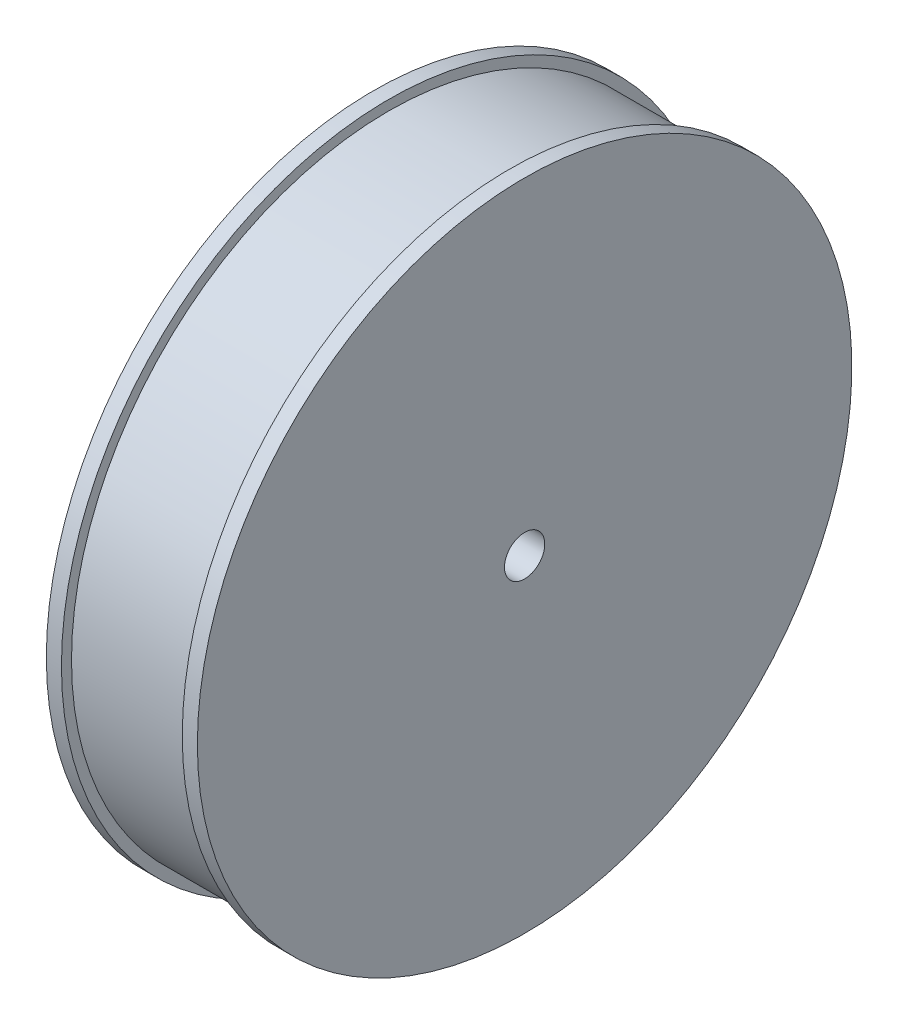
ISO-10303-21;
HEADER;
FILE_DESCRIPTION(('STEP AP214'),'2;1');
FILE_NAME('part.step','',(''),(''),'','','');
FILE_SCHEMA(('AUTOMOTIVE_DESIGN { 1 0 10303 214 1 1 1 1 }'));
ENDSEC;
DATA;
#1=APPLICATION_CONTEXT('core data for automotive mechanical design processes');
#2=APPLICATION_PROTOCOL_DEFINITION('international standard','automotive_design',2000,#1);
#3=PRODUCT_CONTEXT('',#1,'mechanical');
#4=PRODUCT('Part','Part','',(#3));
#5=PRODUCT_RELATED_PRODUCT_CATEGORY('part','',(#4));
#6=PRODUCT_DEFINITION_FORMATION('','',#4);
#7=PRODUCT_DEFINITION_CONTEXT('part definition',#1,'design');
#8=PRODUCT_DEFINITION('design','',#6,#7);
#9=PRODUCT_DEFINITION_SHAPE('','',#8);
#10=(LENGTH_UNIT() NAMED_UNIT(*) SI_UNIT(.MILLI.,.METRE.));
#11=(NAMED_UNIT(*) PLANE_ANGLE_UNIT() SI_UNIT($,.RADIAN.));
#12=(NAMED_UNIT(*) SI_UNIT($,.STERADIAN.) SOLID_ANGLE_UNIT());
#13=UNCERTAINTY_MEASURE_WITH_UNIT(LENGTH_MEASURE(1.E-05),#10,'distance_accuracy_value','');
#14=(GEOMETRIC_REPRESENTATION_CONTEXT(3) GLOBAL_UNCERTAINTY_ASSIGNED_CONTEXT((#13)) GLOBAL_UNIT_ASSIGNED_CONTEXT((#10,
#11,#12)) REPRESENTATION_CONTEXT('',''));
#15=CARTESIAN_POINT('',(0.,0.,0.));
#16=DIRECTION('',(0.,0.,1.));
#17=DIRECTION('',(1.,0.,0.));
#18=AXIS2_PLACEMENT_3D('',#15,#16,#17);
#19=CARTESIAN_POINT('',(-15.,0.,0.));
#20=DIRECTION('',(-1.,0.,0.));
#21=DIRECTION('',(0.,0.,1.));
#22=AXIS2_PLACEMENT_3D('',#19,#20,#21);
#23=CYLINDRICAL_SURFACE('',#22,4.);
#24=CARTESIAN_POINT('',(15.,0.,0.));
#25=DIRECTION('',(-1.,0.,0.));
#26=DIRECTION('',(0.,0.,1.));
#27=AXIS2_PLACEMENT_3D('',#24,#25,#26);
#28=CIRCLE('',#27,4.);
#29=CARTESIAN_POINT('',(15.,0.,4.));
#30=VERTEX_POINT('',#29);
#31=EDGE_CURVE('E10',#30,#30,#28,.T.);
#32=ORIENTED_EDGE('',*,*,#31,.F.);
#33=EDGE_LOOP('',(#32));
#34=FACE_BOUND('',#33,.T.);
#35=CARTESIAN_POINT('',(-15.,0.,0.));
#36=DIRECTION('',(-1.,0.,0.));
#37=DIRECTION('',(0.,0.,1.));
#38=AXIS2_PLACEMENT_3D('',#35,#36,#37);
#39=CIRCLE('',#38,4.);
#40=CARTESIAN_POINT('',(-15.,0.,4.));
#41=VERTEX_POINT('',#40);
#42=EDGE_CURVE('E59',#41,#41,#39,.T.);
#43=ORIENTED_EDGE('',*,*,#42,.T.);
#44=EDGE_LOOP('',(#43));
#45=FACE_BOUND('',#44,.T.);
#46=ADVANCED_FACE('F31',(#34,#45),#23,.F.);
#47=CARTESIAN_POINT('',(15.,4.,0.));
#48=DIRECTION('',(-1.,0.,0.));
#49=DIRECTION('',(0.,0.,1.));
#50=AXIS2_PLACEMENT_3D('',#47,#48,#49);
#51=PLANE('',#50);
#52=CARTESIAN_POINT('',(15.,0.,0.));
#53=DIRECTION('',(-1.,0.,0.));
#54=DIRECTION('',(0.,0.,1.));
#55=AXIS2_PLACEMENT_3D('',#52,#53,#54);
#56=CIRCLE('',#55,65.);
#57=CARTESIAN_POINT('',(15.,0.,65.));
#58=VERTEX_POINT('',#57);
#59=EDGE_CURVE('E37',#58,#58,#56,.T.);
#60=ORIENTED_EDGE('',*,*,#59,.F.);
#61=EDGE_LOOP('',(#60));
#62=FACE_BOUND('',#61,.T.);
#63=ORIENTED_EDGE('',*,*,#31,.T.);
#64=EDGE_LOOP('',(#63));
#65=FACE_BOUND('',#64,.T.);
#66=ADVANCED_FACE('F96',(#62,#65),#51,.F.);
#67=CARTESIAN_POINT('',(-15.,0.,0.));
#68=DIRECTION('',(-1.,0.,0.));
#69=DIRECTION('',(0.,0.,1.));
#70=AXIS2_PLACEMENT_3D('',#67,#68,#69);
#71=CYLINDRICAL_SURFACE('',#70,65.);
#72=CARTESIAN_POINT('',(12.,0.,0.));
#73=DIRECTION('',(-1.,0.,0.));
#74=DIRECTION('',(0.,0.,1.));
#75=AXIS2_PLACEMENT_3D('',#72,#73,#74);
#76=CIRCLE('',#75,65.);
#77=CARTESIAN_POINT('',(12.,0.,65.));
#78=VERTEX_POINT('',#77);
#79=EDGE_CURVE('E41',#78,#78,#76,.T.);
#80=ORIENTED_EDGE('',*,*,#79,.F.);
#81=EDGE_LOOP('',(#80));
#82=FACE_BOUND('',#81,.T.);
#83=ORIENTED_EDGE('',*,*,#59,.T.);
#84=EDGE_LOOP('',(#83));
#85=FACE_BOUND('',#84,.T.);
#86=ADVANCED_FACE('F91',(#82,#85),#71,.T.);
#87=CARTESIAN_POINT('',(12.,65.,0.));
#88=DIRECTION('',(1.,0.,0.));
#89=DIRECTION('',(0.,0.,-1.));
#90=AXIS2_PLACEMENT_3D('',#87,#88,#89);
#91=PLANE('',#90);
#92=CARTESIAN_POINT('',(12.,0.,0.));
#93=DIRECTION('',(-1.,0.,0.));
#94=DIRECTION('',(0.,0.,1.));
#95=AXIS2_PLACEMENT_3D('',#92,#93,#94);
#96=CIRCLE('',#95,63.);
#97=CARTESIAN_POINT('',(12.,0.,63.));
#98=VERTEX_POINT('',#97);
#99=EDGE_CURVE('E45',#98,#98,#96,.T.);
#100=ORIENTED_EDGE('',*,*,#99,.F.);
#101=EDGE_LOOP('',(#100));
#102=FACE_BOUND('',#101,.T.);
#103=ORIENTED_EDGE('',*,*,#79,.T.);
#104=EDGE_LOOP('',(#103));
#105=FACE_BOUND('',#104,.T.);
#106=ADVANCED_FACE('F85',(#102,#105),#91,.F.);
#107=CARTESIAN_POINT('',(-15.,0.,0.));
#108=DIRECTION('',(-1.,0.,0.));
#109=DIRECTION('',(0.,0.,1.));
#110=AXIS2_PLACEMENT_3D('',#107,#108,#109);
#111=CYLINDRICAL_SURFACE('',#110,63.);
#112=CARTESIAN_POINT('',(-12.,0.,0.));
#113=DIRECTION('',(-1.,0.,0.));
#114=DIRECTION('',(0.,0.,1.));
#115=AXIS2_PLACEMENT_3D('',#112,#113,#114);
#116=CIRCLE('',#115,63.);
#117=CARTESIAN_POINT('',(-12.,0.,63.));
#118=VERTEX_POINT('',#117);
#119=EDGE_CURVE('E50',#118,#118,#116,.T.);
#120=ORIENTED_EDGE('',*,*,#119,.F.);
#121=EDGE_LOOP('',(#120));
#122=FACE_BOUND('',#121,.T.);
#123=ORIENTED_EDGE('',*,*,#99,.T.);
#124=EDGE_LOOP('',(#123));
#125=FACE_BOUND('',#124,.T.);
#126=ADVANCED_FACE('F79',(#122,#125),#111,.T.);
#127=CARTESIAN_POINT('',(-12.,65.,0.));
#128=DIRECTION('',(-1.,0.,0.));
#129=DIRECTION('',(0.,0.,1.));
#130=AXIS2_PLACEMENT_3D('',#127,#128,#129);
#131=PLANE('',#130);
#132=CARTESIAN_POINT('',(-12.,0.,0.));
#133=DIRECTION('',(-1.,0.,0.));
#134=DIRECTION('',(0.,0.,1.));
#135=AXIS2_PLACEMENT_3D('',#132,#133,#134);
#136=CIRCLE('',#135,65.);
#137=CARTESIAN_POINT('',(-12.,0.,65.));
#138=VERTEX_POINT('',#137);
#139=EDGE_CURVE('E53',#138,#138,#136,.T.);
#140=ORIENTED_EDGE('',*,*,#139,.F.);
#141=EDGE_LOOP('',(#140));
#142=FACE_BOUND('',#141,.T.);
#143=ORIENTED_EDGE('',*,*,#119,.T.);
#144=EDGE_LOOP('',(#143));
#145=FACE_BOUND('',#144,.T.);
#146=ADVANCED_FACE('F73',(#142,#145),#131,.F.);
#147=CARTESIAN_POINT('',(-15.,0.,0.));
#148=DIRECTION('',(-1.,0.,0.));
#149=DIRECTION('',(0.,0.,1.));
#150=AXIS2_PLACEMENT_3D('',#147,#148,#149);
#151=CYLINDRICAL_SURFACE('',#150,65.);
#152=CARTESIAN_POINT('',(-15.,0.,0.));
#153=DIRECTION('',(-1.,0.,0.));
#154=DIRECTION('',(0.,0.,1.));
#155=AXIS2_PLACEMENT_3D('',#152,#153,#154);
#156=CIRCLE('',#155,65.);
#157=CARTESIAN_POINT('',(-15.,0.,65.));
#158=VERTEX_POINT('',#157);
#159=EDGE_CURVE('E56',#158,#158,#156,.T.);
#160=ORIENTED_EDGE('',*,*,#159,.F.);
#161=EDGE_LOOP('',(#160));
#162=FACE_BOUND('',#161,.T.);
#163=ORIENTED_EDGE('',*,*,#139,.T.);
#164=EDGE_LOOP('',(#163));
#165=FACE_BOUND('',#164,.T.);
#166=ADVANCED_FACE('F67',(#162,#165),#151,.T.);
#167=CARTESIAN_POINT('',(-15.,4.,0.));
#168=DIRECTION('',(1.,0.,0.));
#169=DIRECTION('',(0.,0.,-1.));
#170=AXIS2_PLACEMENT_3D('',#167,#168,#169);
#171=PLANE('',#170);
#172=ORIENTED_EDGE('',*,*,#42,.F.);
#173=EDGE_LOOP('',(#172));
#174=FACE_BOUND('',#173,.T.);
#175=ORIENTED_EDGE('',*,*,#159,.T.);
#176=EDGE_LOOP('',(#175));
#177=FACE_BOUND('',#176,.T.);
#178=ADVANCED_FACE('F64',(#174,#177),#171,.F.);
#179=CLOSED_SHELL('',(#46,#66,#86,#106,#126,#146,#166,#178));
#180=MANIFOLD_SOLID_BREP('B2',#179);
#181=ADVANCED_BREP_SHAPE_REPRESENTATION('',(#18,#180),#14);
#182=SHAPE_DEFINITION_REPRESENTATION(#9,#181);
ENDSEC;
END-ISO-10303-21;
